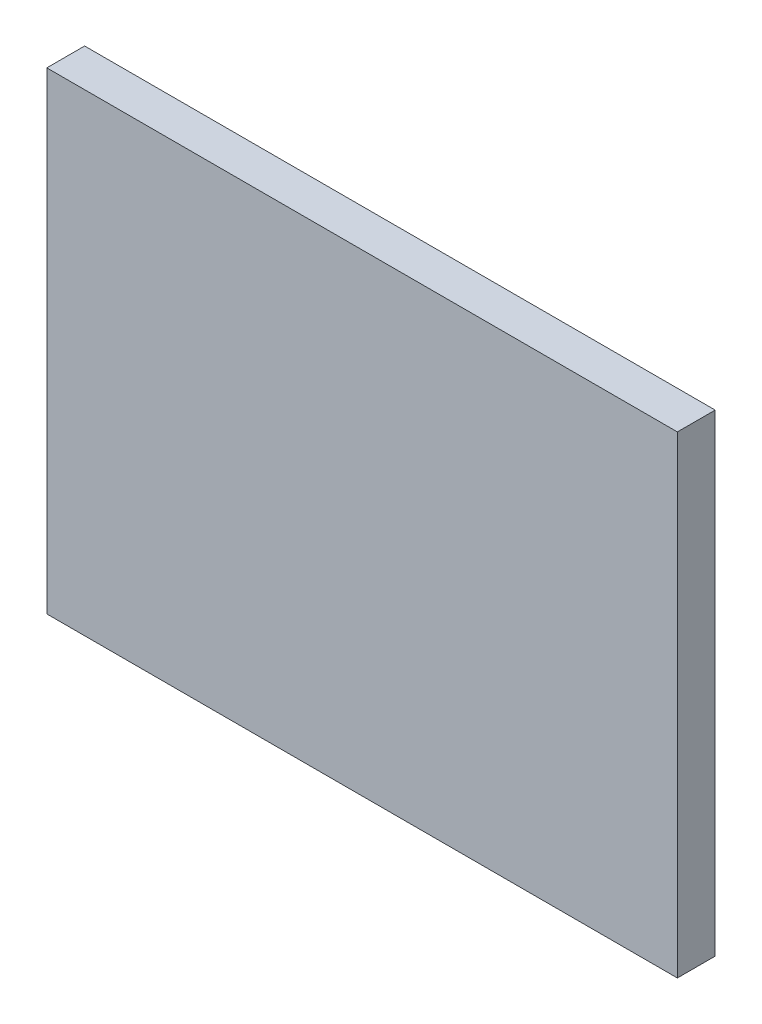
ISO-10303-21;
HEADER;
FILE_DESCRIPTION(('STEP AP214'),'2;1');
FILE_NAME('part.step','',(''),(''),'','','');
FILE_SCHEMA(('AUTOMOTIVE_DESIGN { 1 0 10303 214 1 1 1 1 }'));
ENDSEC;
DATA;
#1=APPLICATION_CONTEXT('core data for automotive mechanical design processes');
#2=APPLICATION_PROTOCOL_DEFINITION('international standard','automotive_design',2000,#1);
#3=PRODUCT_CONTEXT('',#1,'mechanical');
#4=PRODUCT('Part','Part','',(#3));
#5=PRODUCT_RELATED_PRODUCT_CATEGORY('part','',(#4));
#6=PRODUCT_DEFINITION_FORMATION('','',#4);
#7=PRODUCT_DEFINITION_CONTEXT('part definition',#1,'design');
#8=PRODUCT_DEFINITION('design','',#6,#7);
#9=PRODUCT_DEFINITION_SHAPE('','',#8);
#10=(LENGTH_UNIT() NAMED_UNIT(*) SI_UNIT(.MILLI.,.METRE.));
#11=(NAMED_UNIT(*) PLANE_ANGLE_UNIT() SI_UNIT($,.RADIAN.));
#12=(NAMED_UNIT(*) SI_UNIT($,.STERADIAN.) SOLID_ANGLE_UNIT());
#13=UNCERTAINTY_MEASURE_WITH_UNIT(LENGTH_MEASURE(1.E-05),#10,'distance_accuracy_value','');
#14=(GEOMETRIC_REPRESENTATION_CONTEXT(3) GLOBAL_UNCERTAINTY_ASSIGNED_CONTEXT((#13)) GLOBAL_UNIT_ASSIGNED_CONTEXT((#10,
#11,#12)) REPRESENTATION_CONTEXT('',''));
#15=CARTESIAN_POINT('',(0.,0.,0.));
#16=DIRECTION('',(0.,0.,1.));
#17=DIRECTION('',(1.,0.,0.));
#18=AXIS2_PLACEMENT_3D('',#15,#16,#17);
#19=CARTESIAN_POINT('',(0.,0.,1.2));
#20=DIRECTION('',(-1.,0.,0.));
#21=DIRECTION('',(0.,0.,1.));
#22=AXIS2_PLACEMENT_3D('',#19,#20,#21);
#23=PLANE('',#22);
#24=DIRECTION('',(0.,1.,0.));
#25=VECTOR('',#24,1.);
#26=CARTESIAN_POINT('',(0.,0.,0.));
#27=LINE('',#26,#25);
#28=CARTESIAN_POINT('',(0.,0.,0.));
#29=VERTEX_POINT('',#28);
#30=CARTESIAN_POINT('',(0.,15.,0.));
#31=VERTEX_POINT('',#30);
#32=EDGE_CURVE('E96',#29,#31,#27,.T.);
#33=ORIENTED_EDGE('',*,*,#32,.T.);
#34=DIRECTION('',(0.,0.,-1.));
#35=VECTOR('',#34,1.);
#36=CARTESIAN_POINT('',(0.,15.,1.2));
#37=LINE('',#36,#35);
#38=CARTESIAN_POINT('',(0.,15.,1.2));
#39=VERTEX_POINT('',#38);
#40=EDGE_CURVE('E11',#39,#31,#37,.T.);
#41=ORIENTED_EDGE('',*,*,#40,.F.);
#42=DIRECTION('',(0.,1.,0.));
#43=VECTOR('',#42,1.);
#44=CARTESIAN_POINT('',(0.,0.,1.2));
#45=LINE('',#44,#43);
#46=CARTESIAN_POINT('',(0.,0.,1.2));
#47=VERTEX_POINT('',#46);
#48=EDGE_CURVE('E84',#47,#39,#45,.T.);
#49=ORIENTED_EDGE('',*,*,#48,.F.);
#50=DIRECTION('',(0.,0.,-1.));
#51=VECTOR('',#50,1.);
#52=CARTESIAN_POINT('',(0.,0.,1.2));
#53=LINE('',#52,#51);
#54=EDGE_CURVE('E92',#47,#29,#53,.T.);
#55=ORIENTED_EDGE('',*,*,#54,.T.);
#56=EDGE_LOOP('',(#33,#41,#49,#55));
#57=FACE_BOUND('',#56,.T.);
#58=ADVANCED_FACE('F33',(#57),#23,.F.);
#59=CARTESIAN_POINT('',(0.,15.,1.2));
#60=DIRECTION('',(0.,-1.,0.));
#61=DIRECTION('',(0.,0.,-1.));
#62=AXIS2_PLACEMENT_3D('',#59,#60,#61);
#63=PLANE('',#62);
#64=DIRECTION('',(-1.,0.,0.));
#65=VECTOR('',#64,1.);
#66=CARTESIAN_POINT('',(0.,15.,0.));
#67=LINE('',#66,#65);
#68=CARTESIAN_POINT('',(-20.,15.,0.));
#69=VERTEX_POINT('',#68);
#70=EDGE_CURVE('E88',#31,#69,#67,.T.);
#71=ORIENTED_EDGE('',*,*,#70,.T.);
#72=DIRECTION('',(0.,0.,-1.));
#73=VECTOR('',#72,1.);
#74=CARTESIAN_POINT('',(-20.,15.,1.2));
#75=LINE('',#74,#73);
#76=CARTESIAN_POINT('',(-20.,15.,1.2));
#77=VERTEX_POINT('',#76);
#78=EDGE_CURVE('E41',#77,#69,#75,.T.);
#79=ORIENTED_EDGE('',*,*,#78,.F.);
#80=DIRECTION('',(-1.,0.,0.));
#81=VECTOR('',#80,1.);
#82=CARTESIAN_POINT('',(0.,15.,1.2));
#83=LINE('',#82,#81);
#84=EDGE_CURVE('E79',#39,#77,#83,.T.);
#85=ORIENTED_EDGE('',*,*,#84,.F.);
#86=ORIENTED_EDGE('',*,*,#40,.T.);
#87=EDGE_LOOP('',(#71,#79,#85,#86));
#88=FACE_BOUND('',#87,.T.);
#89=ADVANCED_FACE('F87',(#88),#63,.F.);
#90=CARTESIAN_POINT('',(-20.,0.,1.2));
#91=DIRECTION('',(1.,0.,0.));
#92=DIRECTION('',(0.,0.,-1.));
#93=AXIS2_PLACEMENT_3D('',#90,#91,#92);
#94=PLANE('',#93);
#95=DIRECTION('',(0.,-1.,0.));
#96=VECTOR('',#95,1.);
#97=CARTESIAN_POINT('',(-20.,0.,0.));
#98=LINE('',#97,#96);
#99=CARTESIAN_POINT('',(-20.,0.,0.));
#100=VERTEX_POINT('',#99);
#101=EDGE_CURVE('E66',#69,#100,#98,.T.);
#102=ORIENTED_EDGE('',*,*,#101,.T.);
#103=DIRECTION('',(0.,0.,-1.));
#104=VECTOR('',#103,1.);
#105=CARTESIAN_POINT('',(-20.,0.,1.2));
#106=LINE('',#105,#104);
#107=CARTESIAN_POINT('',(-20.,0.,1.2));
#108=VERTEX_POINT('',#107);
#109=EDGE_CURVE('E89',#108,#100,#106,.T.);
#110=ORIENTED_EDGE('',*,*,#109,.F.);
#111=DIRECTION('',(0.,-1.,0.));
#112=VECTOR('',#111,1.);
#113=CARTESIAN_POINT('',(-20.,0.,1.2));
#114=LINE('',#113,#112);
#115=EDGE_CURVE('E82',#77,#108,#114,.T.);
#116=ORIENTED_EDGE('',*,*,#115,.F.);
#117=ORIENTED_EDGE('',*,*,#78,.T.);
#118=EDGE_LOOP('',(#102,#110,#116,#117));
#119=FACE_BOUND('',#118,.T.);
#120=ADVANCED_FACE('F90',(#119),#94,.F.);
#121=CARTESIAN_POINT('',(0.,0.,1.2));
#122=DIRECTION('',(0.,1.,0.));
#123=DIRECTION('',(0.,0.,1.));
#124=AXIS2_PLACEMENT_3D('',#121,#122,#123);
#125=PLANE('',#124);
#126=DIRECTION('',(1.,0.,0.));
#127=VECTOR('',#126,1.);
#128=CARTESIAN_POINT('',(0.,0.,0.));
#129=LINE('',#128,#127);
#130=EDGE_CURVE('E72',#100,#29,#129,.T.);
#131=ORIENTED_EDGE('',*,*,#130,.T.);
#132=ORIENTED_EDGE('',*,*,#54,.F.);
#133=DIRECTION('',(1.,0.,0.));
#134=VECTOR('',#133,1.);
#135=CARTESIAN_POINT('',(0.,0.,1.2));
#136=LINE('',#135,#134);
#137=EDGE_CURVE('E49',#108,#47,#136,.T.);
#138=ORIENTED_EDGE('',*,*,#137,.F.);
#139=ORIENTED_EDGE('',*,*,#109,.T.);
#140=EDGE_LOOP('',(#131,#132,#138,#139));
#141=FACE_BOUND('',#140,.T.);
#142=ADVANCED_FACE('F103',(#141),#125,.F.);
#143=CARTESIAN_POINT('',(0.,0.,1.2));
#144=DIRECTION('',(0.,0.,1.));
#145=DIRECTION('',(1.,0.,0.));
#146=AXIS2_PLACEMENT_3D('',#143,#144,#145);
#147=PLANE('',#146);
#148=ORIENTED_EDGE('',*,*,#48,.T.);
#149=ORIENTED_EDGE('',*,*,#84,.T.);
#150=ORIENTED_EDGE('',*,*,#115,.T.);
#151=ORIENTED_EDGE('',*,*,#137,.T.);
#152=EDGE_LOOP('',(#148,#149,#150,#151));
#153=FACE_BOUND('',#152,.T.);
#154=ADVANCED_FACE('F80',(#153),#147,.T.);
#155=CARTESIAN_POINT('',(0.,0.,0.));
#156=DIRECTION('',(0.,0.,1.));
#157=DIRECTION('',(1.,0.,0.));
#158=AXIS2_PLACEMENT_3D('',#155,#156,#157);
#159=PLANE('',#158);
#160=ORIENTED_EDGE('',*,*,#32,.F.);
#161=ORIENTED_EDGE('',*,*,#130,.F.);
#162=ORIENTED_EDGE('',*,*,#101,.F.);
#163=ORIENTED_EDGE('',*,*,#70,.F.);
#164=EDGE_LOOP('',(#160,#161,#162,#163));
#165=FACE_BOUND('',#164,.T.);
#166=ADVANCED_FACE('F106',(#165),#159,.F.);
#167=CLOSED_SHELL('',(#58,#89,#120,#142,#154,#166));
#168=MANIFOLD_SOLID_BREP('B2',#167);
#169=ADVANCED_BREP_SHAPE_REPRESENTATION('',(#18,#168),#14);
#170=SHAPE_DEFINITION_REPRESENTATION(#9,#169);
ENDSEC;
END-ISO-10303-21;
